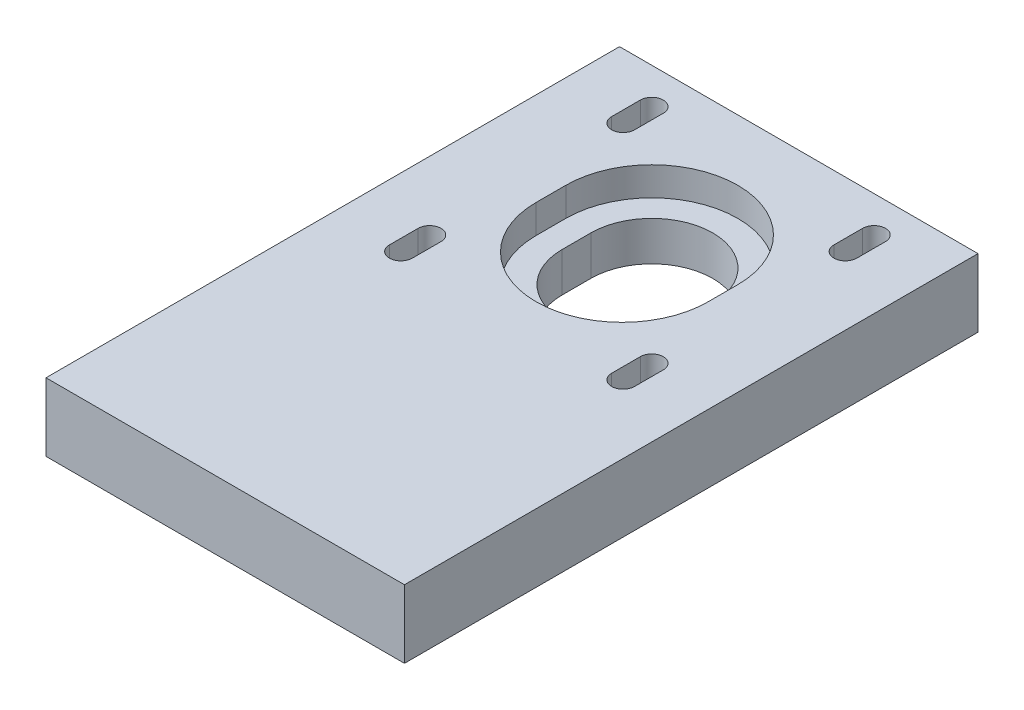
ISO-10303-21;
HEADER;
FILE_DESCRIPTION(('STEP AP214'),'2;1');
FILE_NAME('part.step','',(''),(''),'','','');
FILE_SCHEMA(('AUTOMOTIVE_DESIGN { 1 0 10303 214 1 1 1 1 }'));
ENDSEC;
DATA;
#1=APPLICATION_CONTEXT('core data for automotive mechanical design processes');
#2=APPLICATION_PROTOCOL_DEFINITION('international standard','automotive_design',2000,#1);
#3=PRODUCT_CONTEXT('',#1,'mechanical');
#4=PRODUCT('Part','Part','',(#3));
#5=PRODUCT_RELATED_PRODUCT_CATEGORY('part','',(#4));
#6=PRODUCT_DEFINITION_FORMATION('','',#4);
#7=PRODUCT_DEFINITION_CONTEXT('part definition',#1,'design');
#8=PRODUCT_DEFINITION('design','',#6,#7);
#9=PRODUCT_DEFINITION_SHAPE('','',#8);
#10=(LENGTH_UNIT() NAMED_UNIT(*) SI_UNIT(.MILLI.,.METRE.));
#11=(NAMED_UNIT(*) PLANE_ANGLE_UNIT() SI_UNIT($,.RADIAN.));
#12=(NAMED_UNIT(*) SI_UNIT($,.STERADIAN.) SOLID_ANGLE_UNIT());
#13=UNCERTAINTY_MEASURE_WITH_UNIT(LENGTH_MEASURE(1.E-05),#10,'distance_accuracy_value','');
#14=(GEOMETRIC_REPRESENTATION_CONTEXT(3) GLOBAL_UNCERTAINTY_ASSIGNED_CONTEXT((#13)) GLOBAL_UNIT_ASSIGNED_CONTEXT((#10,
#11,#12)) REPRESENTATION_CONTEXT('',''));
#15=CARTESIAN_POINT('',(0.,0.,0.));
#16=DIRECTION('',(0.,0.,1.));
#17=DIRECTION('',(1.,0.,0.));
#18=AXIS2_PLACEMENT_3D('',#15,#16,#17);
#19=CARTESIAN_POINT('',(0.,0.,-19.5));
#20=DIRECTION('',(0.,1.,0.));
#21=DIRECTION('',(0.,0.,1.));
#22=AXIS2_PLACEMENT_3D('',#19,#20,#21);
#23=CYLINDRICAL_SURFACE('',#22,8.5);
#24=CARTESIAN_POINT('',(0.,5.5,-19.5));
#25=DIRECTION('',(0.,1.,0.));
#26=DIRECTION('',(0.,0.,1.));
#27=AXIS2_PLACEMENT_3D('',#24,#25,#26);
#28=CIRCLE('',#27,8.5);
#29=CARTESIAN_POINT('',(-8.5,5.5,-19.5));
#30=VERTEX_POINT('',#29);
#31=CARTESIAN_POINT('',(8.5,5.5,-19.5));
#32=VERTEX_POINT('',#31);
#33=EDGE_CURVE('E258',#30,#32,#28,.F.);
#34=ORIENTED_EDGE('',*,*,#33,.F.);
#35=DIRECTION('',(0.,1.,0.));
#36=VECTOR('',#35,1.);
#37=CARTESIAN_POINT('',(-8.5,0.,-19.5));
#38=LINE('',#37,#36);
#39=CARTESIAN_POINT('',(-8.5,0.,-19.5));
#40=VERTEX_POINT('',#39);
#41=EDGE_CURVE('E272',#40,#30,#38,.T.);
#42=ORIENTED_EDGE('',*,*,#41,.F.);
#43=CARTESIAN_POINT('',(0.,0.,-19.5));
#44=DIRECTION('',(0.,1.,0.));
#45=DIRECTION('',(0.,0.,1.));
#46=AXIS2_PLACEMENT_3D('',#43,#44,#45);
#47=CIRCLE('',#46,8.5);
#48=CARTESIAN_POINT('',(8.5,0.,-19.5));
#49=VERTEX_POINT('',#48);
#50=EDGE_CURVE('E260',#49,#40,#47,.T.);
#51=ORIENTED_EDGE('',*,*,#50,.F.);
#52=DIRECTION('',(0.,1.,0.));
#53=VECTOR('',#52,1.);
#54=CARTESIAN_POINT('',(8.5,0.,-19.5));
#55=LINE('',#54,#53);
#56=EDGE_CURVE('E273',#49,#32,#55,.T.);
#57=ORIENTED_EDGE('',*,*,#56,.T.);
#58=EDGE_LOOP('',(#34,#42,#51,#57));
#59=FACE_BOUND('',#58,.T.);
#60=ADVANCED_FACE('F33',(#59),#23,.F.);
#61=CARTESIAN_POINT('',(8.5,0.,-19.5));
#62=DIRECTION('',(1.,0.,0.));
#63=DIRECTION('',(0.,0.,-1.));
#64=AXIS2_PLACEMENT_3D('',#61,#62,#63);
#65=PLANE('',#64);
#66=DIRECTION('',(0.,0.,1.));
#67=VECTOR('',#66,1.);
#68=CARTESIAN_POINT('',(8.5,5.5,-19.5));
#69=LINE('',#68,#67);
#70=CARTESIAN_POINT('',(8.5,5.5,-15.5));
#71=VERTEX_POINT('',#70);
#72=EDGE_CURVE('E256',#32,#71,#69,.T.);
#73=ORIENTED_EDGE('',*,*,#72,.F.);
#74=ORIENTED_EDGE('',*,*,#56,.F.);
#75=DIRECTION('',(0.,0.,-1.));
#76=VECTOR('',#75,1.);
#77=CARTESIAN_POINT('',(8.5,0.,-19.5));
#78=LINE('',#77,#76);
#79=CARTESIAN_POINT('',(8.5,0.,-15.5));
#80=VERTEX_POINT('',#79);
#81=EDGE_CURVE('E269',#80,#49,#78,.T.);
#82=ORIENTED_EDGE('',*,*,#81,.F.);
#83=DIRECTION('',(0.,1.,0.));
#84=VECTOR('',#83,1.);
#85=CARTESIAN_POINT('',(8.5,0.,-15.5));
#86=LINE('',#85,#84);
#87=EDGE_CURVE('E277',#80,#71,#86,.T.);
#88=ORIENTED_EDGE('',*,*,#87,.T.);
#89=EDGE_LOOP('',(#73,#74,#82,#88));
#90=FACE_BOUND('',#89,.T.);
#91=ADVANCED_FACE('F474',(#90),#65,.F.);
#92=CARTESIAN_POINT('',(0.,0.,-15.5));
#93=DIRECTION('',(0.,1.,0.));
#94=DIRECTION('',(0.,0.,1.));
#95=AXIS2_PLACEMENT_3D('',#92,#93,#94);
#96=CYLINDRICAL_SURFACE('',#95,8.5);
#97=CARTESIAN_POINT('',(0.,5.5,-15.5));
#98=DIRECTION('',(0.,1.,0.));
#99=DIRECTION('',(0.,0.,1.));
#100=AXIS2_PLACEMENT_3D('',#97,#98,#99);
#101=CIRCLE('',#100,8.5);
#102=CARTESIAN_POINT('',(-8.5,5.5,-15.5));
#103=VERTEX_POINT('',#102);
#104=EDGE_CURVE('E55',#71,#103,#101,.F.);
#105=ORIENTED_EDGE('',*,*,#104,.F.);
#106=ORIENTED_EDGE('',*,*,#87,.F.);
#107=CARTESIAN_POINT('',(0.,0.,-15.5));
#108=DIRECTION('',(0.,1.,0.));
#109=DIRECTION('',(0.,0.,1.));
#110=AXIS2_PLACEMENT_3D('',#107,#108,#109);
#111=CIRCLE('',#110,8.5);
#112=CARTESIAN_POINT('',(-8.5,0.,-15.5));
#113=VERTEX_POINT('',#112);
#114=EDGE_CURVE('E266',#113,#80,#111,.T.);
#115=ORIENTED_EDGE('',*,*,#114,.F.);
#116=DIRECTION('',(0.,1.,0.));
#117=VECTOR('',#116,1.);
#118=CARTESIAN_POINT('',(-8.5,0.,-15.5));
#119=LINE('',#118,#117);
#120=EDGE_CURVE('E280',#113,#103,#119,.T.);
#121=ORIENTED_EDGE('',*,*,#120,.T.);
#122=EDGE_LOOP('',(#105,#106,#115,#121));
#123=FACE_BOUND('',#122,.T.);
#124=ADVANCED_FACE('F480',(#123),#96,.F.);
#125=CARTESIAN_POINT('',(-8.5,0.,-19.5));
#126=DIRECTION('',(-1.,0.,0.));
#127=DIRECTION('',(0.,0.,1.));
#128=AXIS2_PLACEMENT_3D('',#125,#126,#127);
#129=PLANE('',#128);
#130=DIRECTION('',(0.,0.,-1.));
#131=VECTOR('',#130,1.);
#132=CARTESIAN_POINT('',(-8.5,5.5,-19.5));
#133=LINE('',#132,#131);
#134=EDGE_CURVE('E11',#103,#30,#133,.T.);
#135=ORIENTED_EDGE('',*,*,#134,.F.);
#136=ORIENTED_EDGE('',*,*,#120,.F.);
#137=DIRECTION('',(0.,0.,1.));
#138=VECTOR('',#137,1.);
#139=CARTESIAN_POINT('',(-8.5,0.,-19.5));
#140=LINE('',#139,#138);
#141=EDGE_CURVE('E263',#40,#113,#140,.T.);
#142=ORIENTED_EDGE('',*,*,#141,.F.);
#143=ORIENTED_EDGE('',*,*,#41,.T.);
#144=EDGE_LOOP('',(#135,#136,#142,#143));
#145=FACE_BOUND('',#144,.T.);
#146=ADVANCED_FACE('F486',(#145),#129,.F.);
#147=CARTESIAN_POINT('',(25.,9.5,40.));
#148=DIRECTION('',(-1.,0.,0.));
#149=DIRECTION('',(0.,0.,1.));
#150=AXIS2_PLACEMENT_3D('',#147,#148,#149);
#151=PLANE('',#150);
#152=DIRECTION('',(0.,0.,-1.));
#153=VECTOR('',#152,1.);
#154=CARTESIAN_POINT('',(25.,0.,40.));
#155=LINE('',#154,#153);
#156=CARTESIAN_POINT('',(25.,0.,40.));
#157=VERTEX_POINT('',#156);
#158=CARTESIAN_POINT('',(25.,0.,-40.));
#159=VERTEX_POINT('',#158);
#160=EDGE_CURVE('E406',#157,#159,#155,.T.);
#161=ORIENTED_EDGE('',*,*,#160,.T.);
#162=DIRECTION('',(0.,-1.,0.));
#163=VECTOR('',#162,1.);
#164=CARTESIAN_POINT('',(25.,9.5,-40.));
#165=LINE('',#164,#163);
#166=CARTESIAN_POINT('',(25.,9.5,-40.));
#167=VERTEX_POINT('',#166);
#168=EDGE_CURVE('E41',#167,#159,#165,.T.);
#169=ORIENTED_EDGE('',*,*,#168,.F.);
#170=DIRECTION('',(0.,0.,-1.));
#171=VECTOR('',#170,1.);
#172=CARTESIAN_POINT('',(25.,9.5,40.));
#173=LINE('',#172,#171);
#174=CARTESIAN_POINT('',(25.,9.5,40.));
#175=VERTEX_POINT('',#174);
#176=EDGE_CURVE('E413',#175,#167,#173,.T.);
#177=ORIENTED_EDGE('',*,*,#176,.F.);
#178=DIRECTION('',(0.,-1.,0.));
#179=VECTOR('',#178,1.);
#180=CARTESIAN_POINT('',(25.,9.5,40.));
#181=LINE('',#180,#179);
#182=EDGE_CURVE('E423',#175,#157,#181,.T.);
#183=ORIENTED_EDGE('',*,*,#182,.T.);
#184=EDGE_LOOP('',(#161,#169,#177,#183));
#185=FACE_BOUND('',#184,.T.);
#186=ADVANCED_FACE('F35',(#185),#151,.F.);
#187=CARTESIAN_POINT('',(-25.,9.5,-40.));
#188=DIRECTION('',(0.,0.,1.));
#189=DIRECTION('',(1.,0.,0.));
#190=AXIS2_PLACEMENT_3D('',#187,#188,#189);
#191=PLANE('',#190);
#192=DIRECTION('',(-1.,0.,0.));
#193=VECTOR('',#192,1.);
#194=CARTESIAN_POINT('',(-25.,0.,-40.));
#195=LINE('',#194,#193);
#196=CARTESIAN_POINT('',(-25.,0.,-40.));
#197=VERTEX_POINT('',#196);
#198=EDGE_CURVE('E426',#159,#197,#195,.T.);
#199=ORIENTED_EDGE('',*,*,#198,.T.);
#200=DIRECTION('',(0.,-1.,0.));
#201=VECTOR('',#200,1.);
#202=CARTESIAN_POINT('',(-25.,9.5,-40.));
#203=LINE('',#202,#201);
#204=CARTESIAN_POINT('',(-25.,9.5,-40.));
#205=VERTEX_POINT('',#204);
#206=EDGE_CURVE('E436',#205,#197,#203,.T.);
#207=ORIENTED_EDGE('',*,*,#206,.F.);
#208=DIRECTION('',(-1.,0.,0.));
#209=VECTOR('',#208,1.);
#210=CARTESIAN_POINT('',(-25.,9.5,-40.));
#211=LINE('',#210,#209);
#212=EDGE_CURVE('E416',#167,#205,#211,.T.);
#213=ORIENTED_EDGE('',*,*,#212,.F.);
#214=ORIENTED_EDGE('',*,*,#168,.T.);
#215=EDGE_LOOP('',(#199,#207,#213,#214));
#216=FACE_BOUND('',#215,.T.);
#217=ADVANCED_FACE('F441',(#216),#191,.F.);
#218=CARTESIAN_POINT('',(-25.,9.5,40.));
#219=DIRECTION('',(1.,0.,0.));
#220=DIRECTION('',(0.,0.,-1.));
#221=AXIS2_PLACEMENT_3D('',#218,#219,#220);
#222=PLANE('',#221);
#223=DIRECTION('',(0.,0.,1.));
#224=VECTOR('',#223,1.);
#225=CARTESIAN_POINT('',(-25.,0.,40.));
#226=LINE('',#225,#224);
#227=CARTESIAN_POINT('',(-25.,0.,40.));
#228=VERTEX_POINT('',#227);
#229=EDGE_CURVE('E428',#197,#228,#226,.T.);
#230=ORIENTED_EDGE('',*,*,#229,.T.);
#231=DIRECTION('',(0.,-1.,0.));
#232=VECTOR('',#231,1.);
#233=CARTESIAN_POINT('',(-25.,9.5,40.));
#234=LINE('',#233,#232);
#235=CARTESIAN_POINT('',(-25.,9.5,40.));
#236=VERTEX_POINT('',#235);
#237=EDGE_CURVE('E433',#236,#228,#234,.T.);
#238=ORIENTED_EDGE('',*,*,#237,.F.);
#239=DIRECTION('',(0.,0.,1.));
#240=VECTOR('',#239,1.);
#241=CARTESIAN_POINT('',(-25.,9.5,40.));
#242=LINE('',#241,#240);
#243=EDGE_CURVE('E419',#205,#236,#242,.T.);
#244=ORIENTED_EDGE('',*,*,#243,.F.);
#245=ORIENTED_EDGE('',*,*,#206,.T.);
#246=EDGE_LOOP('',(#230,#238,#244,#245));
#247=FACE_BOUND('',#246,.T.);
#248=ADVANCED_FACE('F453',(#247),#222,.F.);
#249=CARTESIAN_POINT('',(-25.,9.5,40.));
#250=DIRECTION('',(0.,0.,-1.));
#251=DIRECTION('',(-1.,0.,0.));
#252=AXIS2_PLACEMENT_3D('',#249,#250,#251);
#253=PLANE('',#252);
#254=DIRECTION('',(1.,0.,0.));
#255=VECTOR('',#254,1.);
#256=CARTESIAN_POINT('',(-25.,0.,40.));
#257=LINE('',#256,#255);
#258=EDGE_CURVE('E417',#228,#157,#257,.T.);
#259=ORIENTED_EDGE('',*,*,#258,.T.);
#260=ORIENTED_EDGE('',*,*,#182,.F.);
#261=DIRECTION('',(1.,0.,0.));
#262=VECTOR('',#261,1.);
#263=CARTESIAN_POINT('',(-25.,9.5,40.));
#264=LINE('',#263,#262);
#265=EDGE_CURVE('E421',#236,#175,#264,.T.);
#266=ORIENTED_EDGE('',*,*,#265,.F.);
#267=ORIENTED_EDGE('',*,*,#237,.T.);
#268=EDGE_LOOP('',(#259,#260,#266,#267));
#269=FACE_BOUND('',#268,.T.);
#270=ADVANCED_FACE('F457',(#269),#253,.F.);
#271=CARTESIAN_POINT('',(0.,9.5,0.));
#272=DIRECTION('',(0.,-1.,0.));
#273=DIRECTION('',(0.,0.,-1.));
#274=AXIS2_PLACEMENT_3D('',#271,#272,#273);
#275=PLANE('',#274);
#276=DIRECTION('',(0.,0.,1.));
#277=VECTOR('',#276,1.);
#278=CARTESIAN_POINT('',(-12.,9.5,-19.5));
#279=LINE('',#278,#277);
#280=CARTESIAN_POINT('',(-12.,9.5,-19.5));
#281=VERTEX_POINT('',#280);
#282=CARTESIAN_POINT('',(-12.,9.5,-15.358826140603));
#283=VERTEX_POINT('',#282);
#284=EDGE_CURVE('E246',#281,#283,#279,.T.);
#285=ORIENTED_EDGE('',*,*,#284,.F.);
#286=CARTESIAN_POINT('',(0.,9.5,-19.5));
#287=DIRECTION('',(0.,1.,0.));
#288=DIRECTION('',(0.,0.,1.));
#289=AXIS2_PLACEMENT_3D('',#286,#287,#288);
#290=CIRCLE('',#289,12.);
#291=CARTESIAN_POINT('',(12.,9.5,-19.5));
#292=VERTEX_POINT('',#291);
#293=EDGE_CURVE('E48',#292,#281,#290,.T.);
#294=ORIENTED_EDGE('',*,*,#293,.F.);
#295=DIRECTION('',(0.,0.,-1.));
#296=VECTOR('',#295,1.);
#297=CARTESIAN_POINT('',(12.,9.5,-19.5));
#298=LINE('',#297,#296);
#299=CARTESIAN_POINT('',(12.,9.5,-15.358826140603));
#300=VERTEX_POINT('',#299);
#301=EDGE_CURVE('E237',#300,#292,#298,.T.);
#302=ORIENTED_EDGE('',*,*,#301,.F.);
#303=CARTESIAN_POINT('',(0.,9.5,-15.358826140603));
#304=DIRECTION('',(0.,1.,0.));
#305=DIRECTION('',(0.,0.,1.));
#306=AXIS2_PLACEMENT_3D('',#303,#304,#305);
#307=CIRCLE('',#306,12.);
#308=EDGE_CURVE('E240',#283,#300,#307,.T.);
#309=ORIENTED_EDGE('',*,*,#308,.F.);
#310=EDGE_LOOP('',(#285,#294,#302,#309));
#311=FACE_BOUND('',#310,.T.);
#312=DIRECTION('',(0.,0.,1.));
#313=VECTOR('',#312,1.);
#314=CARTESIAN_POINT('',(-17.1,9.5,-4.));
#315=LINE('',#314,#313);
#316=CARTESIAN_POINT('',(-17.1,9.5,-4.));
#317=VERTEX_POINT('',#316);
#318=CARTESIAN_POINT('',(-17.1,9.5,0.));
#319=VERTEX_POINT('',#318);
#320=EDGE_CURVE('E300',#317,#319,#315,.T.);
#321=ORIENTED_EDGE('',*,*,#320,.F.);
#322=CARTESIAN_POINT('',(-15.5,9.5,-4.));
#323=DIRECTION('',(0.,1.,0.));
#324=DIRECTION('',(0.,0.,1.));
#325=AXIS2_PLACEMENT_3D('',#322,#323,#324);
#326=CIRCLE('',#325,1.6);
#327=CARTESIAN_POINT('',(-13.9,9.5,-4.));
#328=VERTEX_POINT('',#327);
#329=EDGE_CURVE('E276',#328,#317,#326,.T.);
#330=ORIENTED_EDGE('',*,*,#329,.F.);
#331=DIRECTION('',(0.,0.,-1.));
#332=VECTOR('',#331,1.);
#333=CARTESIAN_POINT('',(-13.9,9.5,-4.));
#334=LINE('',#333,#332);
#335=CARTESIAN_POINT('',(-13.9,9.5,0.));
#336=VERTEX_POINT('',#335);
#337=EDGE_CURVE('E289',#336,#328,#334,.T.);
#338=ORIENTED_EDGE('',*,*,#337,.F.);
#339=CARTESIAN_POINT('',(-15.5,9.5,0.));
#340=DIRECTION('',(0.,1.,0.));
#341=DIRECTION('',(0.,0.,1.));
#342=AXIS2_PLACEMENT_3D('',#339,#340,#341);
#343=CIRCLE('',#342,1.6);
#344=EDGE_CURVE('E303',#319,#336,#343,.T.);
#345=ORIENTED_EDGE('',*,*,#344,.F.);
#346=EDGE_LOOP('',(#321,#330,#338,#345));
#347=FACE_BOUND('',#346,.T.);
#348=DIRECTION('',(0.,0.,1.));
#349=VECTOR('',#348,1.);
#350=CARTESIAN_POINT('',(13.9,9.5,-4.));
#351=LINE('',#350,#349);
#352=CARTESIAN_POINT('',(13.9,9.5,-4.));
#353=VERTEX_POINT('',#352);
#354=CARTESIAN_POINT('',(13.9,9.5,0.));
#355=VERTEX_POINT('',#354);
#356=EDGE_CURVE('E332',#353,#355,#351,.T.);
#357=ORIENTED_EDGE('',*,*,#356,.F.);
#358=CARTESIAN_POINT('',(15.5,9.5,-4.));
#359=DIRECTION('',(0.,1.,0.));
#360=DIRECTION('',(0.,0.,-1.));
#361=AXIS2_PLACEMENT_3D('',#358,#359,#360);
#362=CIRCLE('',#361,1.6);
#363=CARTESIAN_POINT('',(17.1,9.5,-4.));
#364=VERTEX_POINT('',#363);
#365=EDGE_CURVE('E310',#364,#353,#362,.T.);
#366=ORIENTED_EDGE('',*,*,#365,.F.);
#367=DIRECTION('',(0.,0.,-1.));
#368=VECTOR('',#367,1.);
#369=CARTESIAN_POINT('',(17.1,9.5,-4.));
#370=LINE('',#369,#368);
#371=CARTESIAN_POINT('',(17.1,9.5,0.));
#372=VERTEX_POINT('',#371);
#373=EDGE_CURVE('E321',#372,#364,#370,.T.);
#374=ORIENTED_EDGE('',*,*,#373,.F.);
#375=CARTESIAN_POINT('',(15.5,9.5,0.));
#376=DIRECTION('',(0.,1.,0.));
#377=DIRECTION('',(0.,0.,-1.));
#378=AXIS2_PLACEMENT_3D('',#375,#376,#377);
#379=CIRCLE('',#378,1.6);
#380=EDGE_CURVE('E335',#355,#372,#379,.T.);
#381=ORIENTED_EDGE('',*,*,#380,.F.);
#382=EDGE_LOOP('',(#357,#366,#374,#381));
#383=FACE_BOUND('',#382,.T.);
#384=DIRECTION('',(0.,0.,1.));
#385=VECTOR('',#384,1.);
#386=CARTESIAN_POINT('',(-17.1,9.5,-35.));
#387=LINE('',#386,#385);
#388=CARTESIAN_POINT('',(-17.1,9.5,-35.));
#389=VERTEX_POINT('',#388);
#390=CARTESIAN_POINT('',(-17.1,9.5,-31.));
#391=VERTEX_POINT('',#390);
#392=EDGE_CURVE('E364',#389,#391,#387,.T.);
#393=ORIENTED_EDGE('',*,*,#392,.F.);
#394=CARTESIAN_POINT('',(-15.5,9.5,-35.));
#395=DIRECTION('',(0.,1.,0.));
#396=DIRECTION('',(0.,0.,1.));
#397=AXIS2_PLACEMENT_3D('',#394,#395,#396);
#398=CIRCLE('',#397,1.6);
#399=CARTESIAN_POINT('',(-13.9,9.5,-35.));
#400=VERTEX_POINT('',#399);
#401=EDGE_CURVE('E342',#400,#389,#398,.T.);
#402=ORIENTED_EDGE('',*,*,#401,.F.);
#403=DIRECTION('',(0.,0.,-1.));
#404=VECTOR('',#403,1.);
#405=CARTESIAN_POINT('',(-13.9,9.5,-35.));
#406=LINE('',#405,#404);
#407=CARTESIAN_POINT('',(-13.9,9.5,-31.));
#408=VERTEX_POINT('',#407);
#409=EDGE_CURVE('E353',#408,#400,#406,.T.);
#410=ORIENTED_EDGE('',*,*,#409,.F.);
#411=CARTESIAN_POINT('',(-15.5,9.5,-31.));
#412=DIRECTION('',(0.,1.,0.));
#413=DIRECTION('',(0.,0.,1.));
#414=AXIS2_PLACEMENT_3D('',#411,#412,#413);
#415=CIRCLE('',#414,1.6);
#416=EDGE_CURVE('E367',#391,#408,#415,.T.);
#417=ORIENTED_EDGE('',*,*,#416,.F.);
#418=EDGE_LOOP('',(#393,#402,#410,#417));
#419=FACE_BOUND('',#418,.T.);
#420=DIRECTION('',(0.,0.,1.));
#421=VECTOR('',#420,1.);
#422=CARTESIAN_POINT('',(13.9,9.5,-35.));
#423=LINE('',#422,#421);
#424=CARTESIAN_POINT('',(13.9,9.5,-35.));
#425=VERTEX_POINT('',#424);
#426=CARTESIAN_POINT('',(13.9,9.5,-31.));
#427=VERTEX_POINT('',#426);
#428=EDGE_CURVE('E396',#425,#427,#423,.T.);
#429=ORIENTED_EDGE('',*,*,#428,.F.);
#430=CARTESIAN_POINT('',(15.5,9.5,-35.));
#431=DIRECTION('',(0.,1.,0.));
#432=DIRECTION('',(0.,0.,-1.));
#433=AXIS2_PLACEMENT_3D('',#430,#431,#432);
#434=CIRCLE('',#433,1.6);
#435=CARTESIAN_POINT('',(17.1,9.5,-35.));
#436=VERTEX_POINT('',#435);
#437=EDGE_CURVE('E374',#436,#425,#434,.T.);
#438=ORIENTED_EDGE('',*,*,#437,.F.);
#439=DIRECTION('',(0.,0.,-1.));
#440=VECTOR('',#439,1.);
#441=CARTESIAN_POINT('',(17.1,9.5,-35.));
#442=LINE('',#441,#440);
#443=CARTESIAN_POINT('',(17.1,9.5,-31.));
#444=VERTEX_POINT('',#443);
#445=EDGE_CURVE('E385',#444,#436,#442,.T.);
#446=ORIENTED_EDGE('',*,*,#445,.F.);
#447=CARTESIAN_POINT('',(15.5,9.5,-31.));
#448=DIRECTION('',(0.,1.,0.));
#449=DIRECTION('',(0.,0.,-1.));
#450=AXIS2_PLACEMENT_3D('',#447,#448,#449);
#451=CIRCLE('',#450,1.6);
#452=EDGE_CURVE('E399',#427,#444,#451,.T.);
#453=ORIENTED_EDGE('',*,*,#452,.F.);
#454=EDGE_LOOP('',(#429,#438,#446,#453));
#455=FACE_BOUND('',#454,.T.);
#456=ORIENTED_EDGE('',*,*,#176,.T.);
#457=ORIENTED_EDGE('',*,*,#212,.T.);
#458=ORIENTED_EDGE('',*,*,#243,.T.);
#459=ORIENTED_EDGE('',*,*,#265,.T.);
#460=EDGE_LOOP('',(#456,#457,#458,#459));
#461=FACE_BOUND('',#460,.T.);
#462=ADVANCED_FACE('F459',(#311,#347,#383,#419,#455,#461),#275,.F.);
#463=CARTESIAN_POINT('',(0.,0.,0.));
#464=DIRECTION('',(0.,-1.,0.));
#465=DIRECTION('',(0.,0.,-1.));
#466=AXIS2_PLACEMENT_3D('',#463,#464,#465);
#467=PLANE('',#466);
#468=ORIENTED_EDGE('',*,*,#50,.T.);
#469=ORIENTED_EDGE('',*,*,#141,.T.);
#470=ORIENTED_EDGE('',*,*,#114,.T.);
#471=ORIENTED_EDGE('',*,*,#81,.T.);
#472=EDGE_LOOP('',(#468,#469,#470,#471));
#473=FACE_BOUND('',#472,.T.);
#474=CARTESIAN_POINT('',(-15.5,0.,-4.));
#475=DIRECTION('',(0.,1.,0.));
#476=DIRECTION('',(0.,0.,1.));
#477=AXIS2_PLACEMENT_3D('',#474,#475,#476);
#478=CIRCLE('',#477,1.6);
#479=CARTESIAN_POINT('',(-13.9,0.,-4.));
#480=VERTEX_POINT('',#479);
#481=CARTESIAN_POINT('',(-17.1,0.,-4.));
#482=VERTEX_POINT('',#481);
#483=EDGE_CURVE('E285',#480,#482,#478,.T.);
#484=ORIENTED_EDGE('',*,*,#483,.T.);
#485=DIRECTION('',(0.,0.,1.));
#486=VECTOR('',#485,1.);
#487=CARTESIAN_POINT('',(-17.1,0.,-4.));
#488=LINE('',#487,#486);
#489=CARTESIAN_POINT('',(-17.1,0.,0.));
#490=VERTEX_POINT('',#489);
#491=EDGE_CURVE('E288',#482,#490,#488,.T.);
#492=ORIENTED_EDGE('',*,*,#491,.T.);
#493=CARTESIAN_POINT('',(-15.5,0.,0.));
#494=DIRECTION('',(0.,1.,0.));
#495=DIRECTION('',(0.,0.,1.));
#496=AXIS2_PLACEMENT_3D('',#493,#494,#495);
#497=CIRCLE('',#496,1.6);
#498=CARTESIAN_POINT('',(-13.9,0.,0.));
#499=VERTEX_POINT('',#498);
#500=EDGE_CURVE('E292',#490,#499,#497,.T.);
#501=ORIENTED_EDGE('',*,*,#500,.T.);
#502=DIRECTION('',(0.,0.,-1.));
#503=VECTOR('',#502,1.);
#504=CARTESIAN_POINT('',(-13.9,0.,-4.));
#505=LINE('',#504,#503);
#506=EDGE_CURVE('E295',#499,#480,#505,.T.);
#507=ORIENTED_EDGE('',*,*,#506,.T.);
#508=EDGE_LOOP('',(#484,#492,#501,#507));
#509=FACE_BOUND('',#508,.T.);
#510=CARTESIAN_POINT('',(15.5,0.,-4.));
#511=DIRECTION('',(0.,1.,0.));
#512=DIRECTION('',(0.,0.,-1.));
#513=AXIS2_PLACEMENT_3D('',#510,#511,#512);
#514=CIRCLE('',#513,1.6);
#515=CARTESIAN_POINT('',(17.1,0.,-4.));
#516=VERTEX_POINT('',#515);
#517=CARTESIAN_POINT('',(13.9,0.,-4.));
#518=VERTEX_POINT('',#517);
#519=EDGE_CURVE('E317',#516,#518,#514,.T.);
#520=ORIENTED_EDGE('',*,*,#519,.T.);
#521=DIRECTION('',(0.,0.,1.));
#522=VECTOR('',#521,1.);
#523=CARTESIAN_POINT('',(13.9,0.,-4.));
#524=LINE('',#523,#522);
#525=CARTESIAN_POINT('',(13.9,0.,0.));
#526=VERTEX_POINT('',#525);
#527=EDGE_CURVE('E320',#518,#526,#524,.T.);
#528=ORIENTED_EDGE('',*,*,#527,.T.);
#529=CARTESIAN_POINT('',(15.5,0.,0.));
#530=DIRECTION('',(0.,1.,0.));
#531=DIRECTION('',(0.,0.,-1.));
#532=AXIS2_PLACEMENT_3D('',#529,#530,#531);
#533=CIRCLE('',#532,1.6);
#534=CARTESIAN_POINT('',(17.1,0.,0.));
#535=VERTEX_POINT('',#534);
#536=EDGE_CURVE('E324',#526,#535,#533,.T.);
#537=ORIENTED_EDGE('',*,*,#536,.T.);
#538=DIRECTION('',(0.,0.,-1.));
#539=VECTOR('',#538,1.);
#540=CARTESIAN_POINT('',(17.1,0.,-4.));
#541=LINE('',#540,#539);
#542=EDGE_CURVE('E327',#535,#516,#541,.T.);
#543=ORIENTED_EDGE('',*,*,#542,.T.);
#544=EDGE_LOOP('',(#520,#528,#537,#543));
#545=FACE_BOUND('',#544,.T.);
#546=CARTESIAN_POINT('',(-15.5,0.,-35.));
#547=DIRECTION('',(0.,1.,0.));
#548=DIRECTION('',(0.,0.,1.));
#549=AXIS2_PLACEMENT_3D('',#546,#547,#548);
#550=CIRCLE('',#549,1.6);
#551=CARTESIAN_POINT('',(-13.9,0.,-35.));
#552=VERTEX_POINT('',#551);
#553=CARTESIAN_POINT('',(-17.1,0.,-35.));
#554=VERTEX_POINT('',#553);
#555=EDGE_CURVE('E349',#552,#554,#550,.T.);
#556=ORIENTED_EDGE('',*,*,#555,.T.);
#557=DIRECTION('',(0.,0.,1.));
#558=VECTOR('',#557,1.);
#559=CARTESIAN_POINT('',(-17.1,0.,-35.));
#560=LINE('',#559,#558);
#561=CARTESIAN_POINT('',(-17.1,0.,-31.));
#562=VERTEX_POINT('',#561);
#563=EDGE_CURVE('E352',#554,#562,#560,.T.);
#564=ORIENTED_EDGE('',*,*,#563,.T.);
#565=CARTESIAN_POINT('',(-15.5,0.,-31.));
#566=DIRECTION('',(0.,1.,0.));
#567=DIRECTION('',(0.,0.,1.));
#568=AXIS2_PLACEMENT_3D('',#565,#566,#567);
#569=CIRCLE('',#568,1.6);
#570=CARTESIAN_POINT('',(-13.9,0.,-31.));
#571=VERTEX_POINT('',#570);
#572=EDGE_CURVE('E356',#562,#571,#569,.T.);
#573=ORIENTED_EDGE('',*,*,#572,.T.);
#574=DIRECTION('',(0.,0.,-1.));
#575=VECTOR('',#574,1.);
#576=CARTESIAN_POINT('',(-13.9,0.,-35.));
#577=LINE('',#576,#575);
#578=EDGE_CURVE('E359',#571,#552,#577,.T.);
#579=ORIENTED_EDGE('',*,*,#578,.T.);
#580=EDGE_LOOP('',(#556,#564,#573,#579));
#581=FACE_BOUND('',#580,.T.);
#582=CARTESIAN_POINT('',(15.5,0.,-35.));
#583=DIRECTION('',(0.,1.,0.));
#584=DIRECTION('',(0.,0.,-1.));
#585=AXIS2_PLACEMENT_3D('',#582,#583,#584);
#586=CIRCLE('',#585,1.6);
#587=CARTESIAN_POINT('',(17.1,0.,-35.));
#588=VERTEX_POINT('',#587);
#589=CARTESIAN_POINT('',(13.9,0.,-35.));
#590=VERTEX_POINT('',#589);
#591=EDGE_CURVE('E381',#588,#590,#586,.T.);
#592=ORIENTED_EDGE('',*,*,#591,.T.);
#593=DIRECTION('',(0.,0.,1.));
#594=VECTOR('',#593,1.);
#595=CARTESIAN_POINT('',(13.9,0.,-35.));
#596=LINE('',#595,#594);
#597=CARTESIAN_POINT('',(13.9,0.,-31.));
#598=VERTEX_POINT('',#597);
#599=EDGE_CURVE('E384',#590,#598,#596,.T.);
#600=ORIENTED_EDGE('',*,*,#599,.T.);
#601=CARTESIAN_POINT('',(15.5,0.,-31.));
#602=DIRECTION('',(0.,1.,0.));
#603=DIRECTION('',(0.,0.,-1.));
#604=AXIS2_PLACEMENT_3D('',#601,#602,#603);
#605=CIRCLE('',#604,1.6);
#606=CARTESIAN_POINT('',(17.1,0.,-31.));
#607=VERTEX_POINT('',#606);
#608=EDGE_CURVE('E388',#598,#607,#605,.T.);
#609=ORIENTED_EDGE('',*,*,#608,.T.);
#610=DIRECTION('',(0.,0.,-1.));
#611=VECTOR('',#610,1.);
#612=CARTESIAN_POINT('',(17.1,0.,-35.));
#613=LINE('',#612,#611);
#614=EDGE_CURVE('E391',#607,#588,#613,.T.);
#615=ORIENTED_EDGE('',*,*,#614,.T.);
#616=EDGE_LOOP('',(#592,#600,#609,#615));
#617=FACE_BOUND('',#616,.T.);
#618=ORIENTED_EDGE('',*,*,#160,.F.);
#619=ORIENTED_EDGE('',*,*,#258,.F.);
#620=ORIENTED_EDGE('',*,*,#229,.F.);
#621=ORIENTED_EDGE('',*,*,#198,.F.);
#622=EDGE_LOOP('',(#618,#619,#620,#621));
#623=FACE_BOUND('',#622,.T.);
#624=ADVANCED_FACE('F449',(#473,#509,#545,#581,#617,#623),#467,.T.);
#625=CARTESIAN_POINT('',(15.5,0.,-35.));
#626=DIRECTION('',(0.,1.,0.));
#627=DIRECTION('',(0.,0.,1.));
#628=AXIS2_PLACEMENT_3D('',#625,#626,#627);
#629=CYLINDRICAL_SURFACE('',#628,1.6);
#630=ORIENTED_EDGE('',*,*,#437,.T.);
#631=DIRECTION('',(0.,1.,0.));
#632=VECTOR('',#631,1.);
#633=CARTESIAN_POINT('',(13.9,0.,-35.));
#634=LINE('',#633,#632);
#635=EDGE_CURVE('E394',#590,#425,#634,.T.);
#636=ORIENTED_EDGE('',*,*,#635,.F.);
#637=ORIENTED_EDGE('',*,*,#591,.F.);
#638=DIRECTION('',(0.,1.,0.));
#639=VECTOR('',#638,1.);
#640=CARTESIAN_POINT('',(17.1,0.,-35.));
#641=LINE('',#640,#639);
#642=EDGE_CURVE('E404',#588,#436,#641,.T.);
#643=ORIENTED_EDGE('',*,*,#642,.T.);
#644=EDGE_LOOP('',(#630,#636,#637,#643));
#645=FACE_BOUND('',#644,.T.);
#646=ADVANCED_FACE('F467',(#645),#629,.F.);
#647=CARTESIAN_POINT('',(17.1,0.,-35.));
#648=DIRECTION('',(1.,0.,0.));
#649=DIRECTION('',(0.,0.,-1.));
#650=AXIS2_PLACEMENT_3D('',#647,#648,#649);
#651=PLANE('',#650);
#652=ORIENTED_EDGE('',*,*,#445,.T.);
#653=ORIENTED_EDGE('',*,*,#642,.F.);
#654=ORIENTED_EDGE('',*,*,#614,.F.);
#655=DIRECTION('',(0.,1.,0.));
#656=VECTOR('',#655,1.);
#657=CARTESIAN_POINT('',(17.1,0.,-31.));
#658=LINE('',#657,#656);
#659=EDGE_CURVE('E407',#607,#444,#658,.T.);
#660=ORIENTED_EDGE('',*,*,#659,.T.);
#661=EDGE_LOOP('',(#652,#653,#654,#660));
#662=FACE_BOUND('',#661,.T.);
#663=ADVANCED_FACE('F537',(#662),#651,.F.);
#664=CARTESIAN_POINT('',(15.5,0.,-31.));
#665=DIRECTION('',(0.,1.,0.));
#666=DIRECTION('',(0.,0.,1.));
#667=AXIS2_PLACEMENT_3D('',#664,#665,#666);
#668=CYLINDRICAL_SURFACE('',#667,1.6);
#669=ORIENTED_EDGE('',*,*,#452,.T.);
#670=ORIENTED_EDGE('',*,*,#659,.F.);
#671=ORIENTED_EDGE('',*,*,#608,.F.);
#672=DIRECTION('',(0.,1.,0.));
#673=VECTOR('',#672,1.);
#674=CARTESIAN_POINT('',(13.9,0.,-31.));
#675=LINE('',#674,#673);
#676=EDGE_CURVE('E409',#598,#427,#675,.T.);
#677=ORIENTED_EDGE('',*,*,#676,.T.);
#678=EDGE_LOOP('',(#669,#670,#671,#677));
#679=FACE_BOUND('',#678,.T.);
#680=ADVANCED_FACE('F540',(#679),#668,.F.);
#681=CARTESIAN_POINT('',(13.9,0.,-35.));
#682=DIRECTION('',(-1.,0.,0.));
#683=DIRECTION('',(0.,0.,1.));
#684=AXIS2_PLACEMENT_3D('',#681,#682,#683);
#685=PLANE('',#684);
#686=ORIENTED_EDGE('',*,*,#428,.T.);
#687=ORIENTED_EDGE('',*,*,#676,.F.);
#688=ORIENTED_EDGE('',*,*,#599,.F.);
#689=ORIENTED_EDGE('',*,*,#635,.T.);
#690=EDGE_LOOP('',(#686,#687,#688,#689));
#691=FACE_BOUND('',#690,.T.);
#692=ADVANCED_FACE('F535',(#691),#685,.F.);
#693=CARTESIAN_POINT('',(-15.5,0.,-35.));
#694=DIRECTION('',(0.,1.,0.));
#695=DIRECTION('',(0.,0.,1.));
#696=AXIS2_PLACEMENT_3D('',#693,#694,#695);
#697=CYLINDRICAL_SURFACE('',#696,1.6);
#698=ORIENTED_EDGE('',*,*,#401,.T.);
#699=DIRECTION('',(0.,1.,0.));
#700=VECTOR('',#699,1.);
#701=CARTESIAN_POINT('',(-17.1,0.,-35.));
#702=LINE('',#701,#700);
#703=EDGE_CURVE('E362',#554,#389,#702,.T.);
#704=ORIENTED_EDGE('',*,*,#703,.F.);
#705=ORIENTED_EDGE('',*,*,#555,.F.);
#706=DIRECTION('',(0.,1.,0.));
#707=VECTOR('',#706,1.);
#708=CARTESIAN_POINT('',(-13.9,0.,-35.));
#709=LINE('',#708,#707);
#710=EDGE_CURVE('E372',#552,#400,#709,.T.);
#711=ORIENTED_EDGE('',*,*,#710,.T.);
#712=EDGE_LOOP('',(#698,#704,#705,#711));
#713=FACE_BOUND('',#712,.T.);
#714=ADVANCED_FACE('F525',(#713),#697,.F.);
#715=CARTESIAN_POINT('',(-13.9,0.,-35.));
#716=DIRECTION('',(1.,0.,0.));
#717=DIRECTION('',(0.,0.,-1.));
#718=AXIS2_PLACEMENT_3D('',#715,#716,#717);
#719=PLANE('',#718);
#720=ORIENTED_EDGE('',*,*,#409,.T.);
#721=ORIENTED_EDGE('',*,*,#710,.F.);
#722=ORIENTED_EDGE('',*,*,#578,.F.);
#723=DIRECTION('',(0.,1.,0.));
#724=VECTOR('',#723,1.);
#725=CARTESIAN_POINT('',(-13.9,0.,-31.));
#726=LINE('',#725,#724);
#727=EDGE_CURVE('E375',#571,#408,#726,.T.);
#728=ORIENTED_EDGE('',*,*,#727,.T.);
#729=EDGE_LOOP('',(#720,#721,#722,#728));
#730=FACE_BOUND('',#729,.T.);
#731=ADVANCED_FACE('F521',(#730),#719,.F.);
#732=CARTESIAN_POINT('',(-15.5,0.,-31.));
#733=DIRECTION('',(0.,1.,0.));
#734=DIRECTION('',(0.,0.,1.));
#735=AXIS2_PLACEMENT_3D('',#732,#733,#734);
#736=CYLINDRICAL_SURFACE('',#735,1.6);
#737=ORIENTED_EDGE('',*,*,#416,.T.);
#738=ORIENTED_EDGE('',*,*,#727,.F.);
#739=ORIENTED_EDGE('',*,*,#572,.F.);
#740=DIRECTION('',(0.,1.,0.));
#741=VECTOR('',#740,1.);
#742=CARTESIAN_POINT('',(-17.1,0.,-31.));
#743=LINE('',#742,#741);
#744=EDGE_CURVE('E377',#562,#391,#743,.T.);
#745=ORIENTED_EDGE('',*,*,#744,.T.);
#746=EDGE_LOOP('',(#737,#738,#739,#745));
#747=FACE_BOUND('',#746,.T.);
#748=ADVANCED_FACE('F524',(#747),#736,.F.);
#749=CARTESIAN_POINT('',(-17.1,0.,-35.));
#750=DIRECTION('',(-1.,0.,0.));
#751=DIRECTION('',(0.,0.,1.));
#752=AXIS2_PLACEMENT_3D('',#749,#750,#751);
#753=PLANE('',#752);
#754=ORIENTED_EDGE('',*,*,#392,.T.);
#755=ORIENTED_EDGE('',*,*,#744,.F.);
#756=ORIENTED_EDGE('',*,*,#563,.F.);
#757=ORIENTED_EDGE('',*,*,#703,.T.);
#758=EDGE_LOOP('',(#754,#755,#756,#757));
#759=FACE_BOUND('',#758,.T.);
#760=ADVANCED_FACE('F519',(#759),#753,.F.);
#761=CARTESIAN_POINT('',(15.5,0.,-4.));
#762=DIRECTION('',(0.,1.,0.));
#763=DIRECTION('',(0.,0.,1.));
#764=AXIS2_PLACEMENT_3D('',#761,#762,#763);
#765=CYLINDRICAL_SURFACE('',#764,1.6);
#766=ORIENTED_EDGE('',*,*,#365,.T.);
#767=DIRECTION('',(0.,1.,0.));
#768=VECTOR('',#767,1.);
#769=CARTESIAN_POINT('',(13.9,0.,-4.));
#770=LINE('',#769,#768);
#771=EDGE_CURVE('E330',#518,#353,#770,.T.);
#772=ORIENTED_EDGE('',*,*,#771,.F.);
#773=ORIENTED_EDGE('',*,*,#519,.F.);
#774=DIRECTION('',(0.,1.,0.));
#775=VECTOR('',#774,1.);
#776=CARTESIAN_POINT('',(17.1,0.,-4.));
#777=LINE('',#776,#775);
#778=EDGE_CURVE('E340',#516,#364,#777,.T.);
#779=ORIENTED_EDGE('',*,*,#778,.T.);
#780=EDGE_LOOP('',(#766,#772,#773,#779));
#781=FACE_BOUND('',#780,.T.);
#782=ADVANCED_FACE('F509',(#781),#765,.F.);
#783=CARTESIAN_POINT('',(17.1,0.,-4.));
#784=DIRECTION('',(1.,0.,0.));
#785=DIRECTION('',(0.,0.,-1.));
#786=AXIS2_PLACEMENT_3D('',#783,#784,#785);
#787=PLANE('',#786);
#788=ORIENTED_EDGE('',*,*,#373,.T.);
#789=ORIENTED_EDGE('',*,*,#778,.F.);
#790=ORIENTED_EDGE('',*,*,#542,.F.);
#791=DIRECTION('',(0.,1.,0.));
#792=VECTOR('',#791,1.);
#793=CARTESIAN_POINT('',(17.1,0.,0.));
#794=LINE('',#793,#792);
#795=EDGE_CURVE('E343',#535,#372,#794,.T.);
#796=ORIENTED_EDGE('',*,*,#795,.T.);
#797=EDGE_LOOP('',(#788,#789,#790,#796));
#798=FACE_BOUND('',#797,.T.);
#799=ADVANCED_FACE('F505',(#798),#787,.F.);
#800=CARTESIAN_POINT('',(15.5,0.,0.));
#801=DIRECTION('',(0.,1.,0.));
#802=DIRECTION('',(0.,0.,1.));
#803=AXIS2_PLACEMENT_3D('',#800,#801,#802);
#804=CYLINDRICAL_SURFACE('',#803,1.6);
#805=ORIENTED_EDGE('',*,*,#380,.T.);
#806=ORIENTED_EDGE('',*,*,#795,.F.);
#807=ORIENTED_EDGE('',*,*,#536,.F.);
#808=DIRECTION('',(0.,1.,0.));
#809=VECTOR('',#808,1.);
#810=CARTESIAN_POINT('',(13.9,0.,0.));
#811=LINE('',#810,#809);
#812=EDGE_CURVE('E345',#526,#355,#811,.T.);
#813=ORIENTED_EDGE('',*,*,#812,.T.);
#814=EDGE_LOOP('',(#805,#806,#807,#813));
#815=FACE_BOUND('',#814,.T.);
#816=ADVANCED_FACE('F508',(#815),#804,.F.);
#817=CARTESIAN_POINT('',(13.9,0.,-4.));
#818=DIRECTION('',(-1.,0.,0.));
#819=DIRECTION('',(0.,0.,1.));
#820=AXIS2_PLACEMENT_3D('',#817,#818,#819);
#821=PLANE('',#820);
#822=ORIENTED_EDGE('',*,*,#356,.T.);
#823=ORIENTED_EDGE('',*,*,#812,.F.);
#824=ORIENTED_EDGE('',*,*,#527,.F.);
#825=ORIENTED_EDGE('',*,*,#771,.T.);
#826=EDGE_LOOP('',(#822,#823,#824,#825));
#827=FACE_BOUND('',#826,.T.);
#828=ADVANCED_FACE('F503',(#827),#821,.F.);
#829=CARTESIAN_POINT('',(-15.5,0.,-4.));
#830=DIRECTION('',(0.,1.,0.));
#831=DIRECTION('',(0.,0.,1.));
#832=AXIS2_PLACEMENT_3D('',#829,#830,#831);
#833=CYLINDRICAL_SURFACE('',#832,1.6);
#834=ORIENTED_EDGE('',*,*,#329,.T.);
#835=DIRECTION('',(0.,1.,0.));
#836=VECTOR('',#835,1.);
#837=CARTESIAN_POINT('',(-17.1,0.,-4.));
#838=LINE('',#837,#836);
#839=EDGE_CURVE('E298',#482,#317,#838,.T.);
#840=ORIENTED_EDGE('',*,*,#839,.F.);
#841=ORIENTED_EDGE('',*,*,#483,.F.);
#842=DIRECTION('',(0.,1.,0.));
#843=VECTOR('',#842,1.);
#844=CARTESIAN_POINT('',(-13.9,0.,-4.));
#845=LINE('',#844,#843);
#846=EDGE_CURVE('E308',#480,#328,#845,.T.);
#847=ORIENTED_EDGE('',*,*,#846,.T.);
#848=EDGE_LOOP('',(#834,#840,#841,#847));
#849=FACE_BOUND('',#848,.T.);
#850=ADVANCED_FACE('F492',(#849),#833,.F.);
#851=CARTESIAN_POINT('',(-13.9,0.,-4.));
#852=DIRECTION('',(1.,0.,0.));
#853=DIRECTION('',(0.,0.,-1.));
#854=AXIS2_PLACEMENT_3D('',#851,#852,#853);
#855=PLANE('',#854);
#856=ORIENTED_EDGE('',*,*,#337,.T.);
#857=ORIENTED_EDGE('',*,*,#846,.F.);
#858=ORIENTED_EDGE('',*,*,#506,.F.);
#859=DIRECTION('',(0.,1.,0.));
#860=VECTOR('',#859,1.);
#861=CARTESIAN_POINT('',(-13.9,0.,0.));
#862=LINE('',#861,#860);
#863=EDGE_CURVE('E311',#499,#336,#862,.T.);
#864=ORIENTED_EDGE('',*,*,#863,.T.);
#865=EDGE_LOOP('',(#856,#857,#858,#864));
#866=FACE_BOUND('',#865,.T.);
#867=ADVANCED_FACE('F488',(#866),#855,.F.);
#868=CARTESIAN_POINT('',(-15.5,0.,0.));
#869=DIRECTION('',(0.,1.,0.));
#870=DIRECTION('',(0.,0.,1.));
#871=AXIS2_PLACEMENT_3D('',#868,#869,#870);
#872=CYLINDRICAL_SURFACE('',#871,1.6);
#873=ORIENTED_EDGE('',*,*,#344,.T.);
#874=ORIENTED_EDGE('',*,*,#863,.F.);
#875=ORIENTED_EDGE('',*,*,#500,.F.);
#876=DIRECTION('',(0.,1.,0.));
#877=VECTOR('',#876,1.);
#878=CARTESIAN_POINT('',(-17.1,0.,0.));
#879=LINE('',#878,#877);
#880=EDGE_CURVE('E313',#490,#319,#879,.T.);
#881=ORIENTED_EDGE('',*,*,#880,.T.);
#882=EDGE_LOOP('',(#873,#874,#875,#881));
#883=FACE_BOUND('',#882,.T.);
#884=ADVANCED_FACE('F491',(#883),#872,.F.);
#885=CARTESIAN_POINT('',(-17.1,0.,-4.));
#886=DIRECTION('',(-1.,0.,0.));
#887=DIRECTION('',(0.,0.,1.));
#888=AXIS2_PLACEMENT_3D('',#885,#886,#887);
#889=PLANE('',#888);
#890=ORIENTED_EDGE('',*,*,#320,.T.);
#891=ORIENTED_EDGE('',*,*,#880,.F.);
#892=ORIENTED_EDGE('',*,*,#491,.F.);
#893=ORIENTED_EDGE('',*,*,#839,.T.);
#894=EDGE_LOOP('',(#890,#891,#892,#893));
#895=FACE_BOUND('',#894,.T.);
#896=ADVANCED_FACE('F496',(#895),#889,.F.);
#897=CARTESIAN_POINT('',(0.,5.5,-19.5));
#898=DIRECTION('',(0.,1.,0.));
#899=DIRECTION('',(0.,0.,1.));
#900=AXIS2_PLACEMENT_3D('',#897,#898,#899);
#901=PLANE('',#900);
#902=CARTESIAN_POINT('',(0.,5.5,-19.5));
#903=DIRECTION('',(0.,1.,0.));
#904=DIRECTION('',(0.,0.,1.));
#905=AXIS2_PLACEMENT_3D('',#902,#903,#904);
#906=CIRCLE('',#905,12.);
#907=CARTESIAN_POINT('',(12.,5.5,-19.5));
#908=VERTEX_POINT('',#907);
#909=CARTESIAN_POINT('',(-12.,5.5,-19.5));
#910=VERTEX_POINT('',#909);
#911=EDGE_CURVE('E219',#908,#910,#906,.T.);
#912=ORIENTED_EDGE('',*,*,#911,.T.);
#913=DIRECTION('',(0.,0.,1.));
#914=VECTOR('',#913,1.);
#915=CARTESIAN_POINT('',(-12.,5.5,-19.5));
#916=LINE('',#915,#914);
#917=CARTESIAN_POINT('',(-12.,5.5,-15.358826140603));
#918=VERTEX_POINT('',#917);
#919=EDGE_CURVE('E228',#910,#918,#916,.T.);
#920=ORIENTED_EDGE('',*,*,#919,.T.);
#921=CARTESIAN_POINT('',(0.,5.5,-15.358826140603));
#922=DIRECTION('',(0.,1.,0.));
#923=DIRECTION('',(0.,0.,1.));
#924=AXIS2_PLACEMENT_3D('',#921,#922,#923);
#925=CIRCLE('',#924,12.);
#926=CARTESIAN_POINT('',(12.,5.5,-15.358826140603));
#927=VERTEX_POINT('',#926);
#928=EDGE_CURVE('E233',#918,#927,#925,.T.);
#929=ORIENTED_EDGE('',*,*,#928,.T.);
#930=DIRECTION('',(0.,0.,-1.));
#931=VECTOR('',#930,1.);
#932=CARTESIAN_POINT('',(12.,5.5,-19.5));
#933=LINE('',#932,#931);
#934=EDGE_CURVE('E225',#927,#908,#933,.T.);
#935=ORIENTED_EDGE('',*,*,#934,.T.);
#936=EDGE_LOOP('',(#912,#920,#929,#935));
#937=FACE_BOUND('',#936,.T.);
#938=ORIENTED_EDGE('',*,*,#33,.T.);
#939=ORIENTED_EDGE('',*,*,#72,.T.);
#940=ORIENTED_EDGE('',*,*,#104,.T.);
#941=ORIENTED_EDGE('',*,*,#134,.T.);
#942=EDGE_LOOP('',(#938,#939,#940,#941));
#943=FACE_BOUND('',#942,.T.);
#944=ADVANCED_FACE('F235',(#937,#943),#901,.T.);
#945=CARTESIAN_POINT('',(0.,5.5,-19.5));
#946=DIRECTION('',(0.,1.,0.));
#947=DIRECTION('',(0.,0.,1.));
#948=AXIS2_PLACEMENT_3D('',#945,#946,#947);
#949=CYLINDRICAL_SURFACE('',#948,12.);
#950=ORIENTED_EDGE('',*,*,#293,.T.);
#951=DIRECTION('',(0.,1.,0.));
#952=VECTOR('',#951,1.);
#953=CARTESIAN_POINT('',(-12.,5.5,-19.5));
#954=LINE('',#953,#952);
#955=EDGE_CURVE('E215',#910,#281,#954,.T.);
#956=ORIENTED_EDGE('',*,*,#955,.F.);
#957=ORIENTED_EDGE('',*,*,#911,.F.);
#958=DIRECTION('',(0.,1.,0.));
#959=VECTOR('',#958,1.);
#960=CARTESIAN_POINT('',(12.,5.5,-19.5));
#961=LINE('',#960,#959);
#962=EDGE_CURVE('E250',#908,#292,#961,.T.);
#963=ORIENTED_EDGE('',*,*,#962,.T.);
#964=EDGE_LOOP('',(#950,#956,#957,#963));
#965=FACE_BOUND('',#964,.T.);
#966=ADVANCED_FACE('F217',(#965),#949,.F.);
#967=CARTESIAN_POINT('',(12.,5.5,-19.5));
#968=DIRECTION('',(1.,0.,0.));
#969=DIRECTION('',(0.,0.,-1.));
#970=AXIS2_PLACEMENT_3D('',#967,#968,#969);
#971=PLANE('',#970);
#972=ORIENTED_EDGE('',*,*,#301,.T.);
#973=ORIENTED_EDGE('',*,*,#962,.F.);
#974=ORIENTED_EDGE('',*,*,#934,.F.);
#975=DIRECTION('',(0.,1.,0.));
#976=VECTOR('',#975,1.);
#977=CARTESIAN_POINT('',(12.,5.5,-15.358826140603));
#978=LINE('',#977,#976);
#979=EDGE_CURVE('E252',#927,#300,#978,.T.);
#980=ORIENTED_EDGE('',*,*,#979,.T.);
#981=EDGE_LOOP('',(#972,#973,#974,#980));
#982=FACE_BOUND('',#981,.T.);
#983=ADVANCED_FACE('F635',(#982),#971,.F.);
#984=CARTESIAN_POINT('',(0.,5.5,-15.358826140603));
#985=DIRECTION('',(0.,1.,0.));
#986=DIRECTION('',(0.,0.,1.));
#987=AXIS2_PLACEMENT_3D('',#984,#985,#986);
#988=CYLINDRICAL_SURFACE('',#987,12.);
#989=ORIENTED_EDGE('',*,*,#308,.T.);
#990=ORIENTED_EDGE('',*,*,#979,.F.);
#991=ORIENTED_EDGE('',*,*,#928,.F.);
#992=DIRECTION('',(0.,1.,0.));
#993=VECTOR('',#992,1.);
#994=CARTESIAN_POINT('',(-12.,5.5,-15.358826140603));
#995=LINE('',#994,#993);
#996=EDGE_CURVE('E224',#918,#283,#995,.T.);
#997=ORIENTED_EDGE('',*,*,#996,.T.);
#998=EDGE_LOOP('',(#989,#990,#991,#997));
#999=FACE_BOUND('',#998,.T.);
#1000=ADVANCED_FACE('F642',(#999),#988,.F.);
#1001=CARTESIAN_POINT('',(-12.,5.5,-19.5));
#1002=DIRECTION('',(-1.,0.,0.));
#1003=DIRECTION('',(0.,0.,1.));
#1004=AXIS2_PLACEMENT_3D('',#1001,#1002,#1003);
#1005=PLANE('',#1004);
#1006=ORIENTED_EDGE('',*,*,#284,.T.);
#1007=ORIENTED_EDGE('',*,*,#996,.F.);
#1008=ORIENTED_EDGE('',*,*,#919,.F.);
#1009=ORIENTED_EDGE('',*,*,#955,.T.);
#1010=EDGE_LOOP('',(#1006,#1007,#1008,#1009));
#1011=FACE_BOUND('',#1010,.T.);
#1012=ADVANCED_FACE('F229',(#1011),#1005,.F.);
#1013=CLOSED_SHELL('',(#60,#91,#124,#146,#186,#217,#248,#270,#462,#624,#646,#663,#680,#692,#714,
#731,#748,#760,#782,#799,#816,#828,#850,#867,#884,#896,#944,#966,#983,#1000,#1012));
#1014=MANIFOLD_SOLID_BREP('B2',#1013);
#1015=ADVANCED_BREP_SHAPE_REPRESENTATION('',(#18,#1014),#14);
#1016=SHAPE_DEFINITION_REPRESENTATION(#9,#1015);
ENDSEC;
END-ISO-10303-21;
